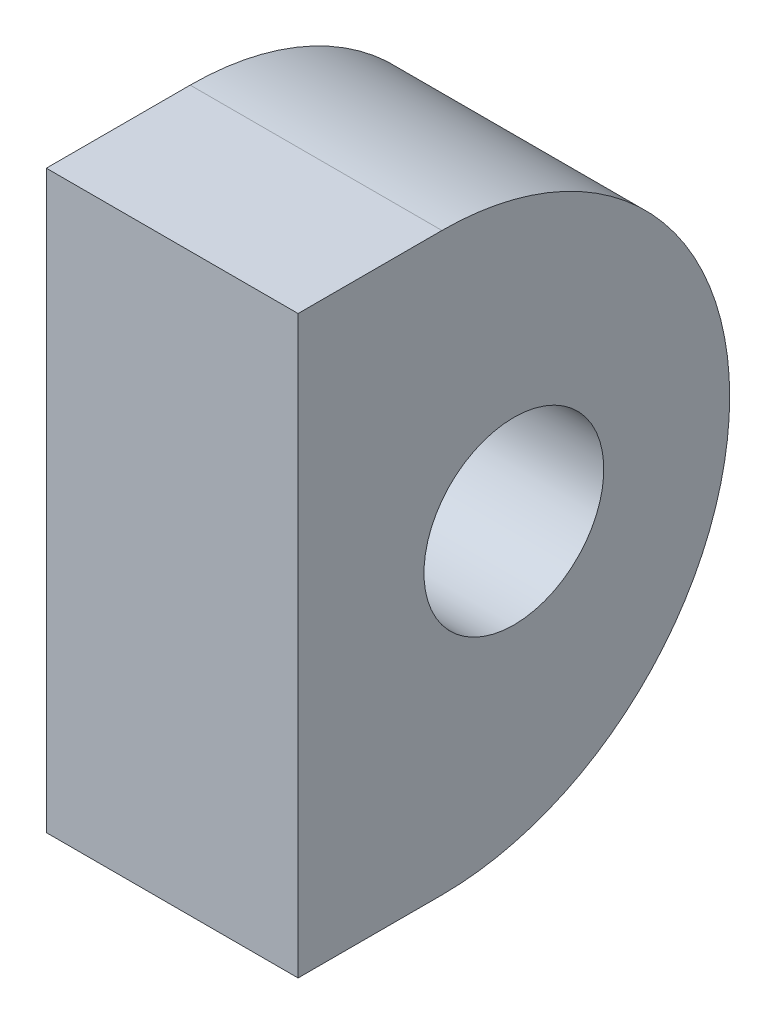
ISO-10303-21;
HEADER;
FILE_DESCRIPTION(('STEP AP214'),'2;1');
FILE_NAME('part.step','',(''),(''),'','','');
FILE_SCHEMA(('AUTOMOTIVE_DESIGN { 1 0 10303 214 1 1 1 1 }'));
ENDSEC;
DATA;
#1=APPLICATION_CONTEXT('core data for automotive mechanical design processes');
#2=APPLICATION_PROTOCOL_DEFINITION('international standard','automotive_design',2000,#1);
#3=PRODUCT_CONTEXT('',#1,'mechanical');
#4=PRODUCT('Part','Part','',(#3));
#5=PRODUCT_RELATED_PRODUCT_CATEGORY('part','',(#4));
#6=PRODUCT_DEFINITION_FORMATION('','',#4);
#7=PRODUCT_DEFINITION_CONTEXT('part definition',#1,'design');
#8=PRODUCT_DEFINITION('design','',#6,#7);
#9=PRODUCT_DEFINITION_SHAPE('','',#8);
#10=(LENGTH_UNIT() NAMED_UNIT(*) SI_UNIT(.MILLI.,.METRE.));
#11=(NAMED_UNIT(*) PLANE_ANGLE_UNIT() SI_UNIT($,.RADIAN.));
#12=(NAMED_UNIT(*) SI_UNIT($,.STERADIAN.) SOLID_ANGLE_UNIT());
#13=UNCERTAINTY_MEASURE_WITH_UNIT(LENGTH_MEASURE(1.E-05),#10,'distance_accuracy_value','');
#14=(GEOMETRIC_REPRESENTATION_CONTEXT(3) GLOBAL_UNCERTAINTY_ASSIGNED_CONTEXT((#13)) GLOBAL_UNIT_ASSIGNED_CONTEXT((#10,
#11,#12)) REPRESENTATION_CONTEXT('',''));
#15=CARTESIAN_POINT('',(0.,0.,0.));
#16=DIRECTION('',(0.,0.,1.));
#17=DIRECTION('',(1.,0.,0.));
#18=AXIS2_PLACEMENT_3D('',#15,#16,#17);
#19=CARTESIAN_POINT('',(0.,0.,-38.1));
#20=DIRECTION('',(1.,0.,0.));
#21=DIRECTION('',(0.,1.,0.));
#22=AXIS2_PLACEMENT_3D('',#19,#20,#21);
#23=PLANE('',#22);
#24=CARTESIAN_POINT('',(0.,25.4,-19.05));
#25=DIRECTION('',(-1.,0.,0.));
#26=DIRECTION('',(0.,1.,0.));
#27=AXIS2_PLACEMENT_3D('',#24,#25,#26);
#28=CIRCLE('',#27,7.9375);
#29=CARTESIAN_POINT('',(0.,33.3375,-19.05));
#30=VERTEX_POINT('',#29);
#31=EDGE_CURVE('E131',#30,#30,#28,.T.);
#32=ORIENTED_EDGE('',*,*,#31,.F.);
#33=EDGE_LOOP('',(#32));
#34=FACE_BOUND('',#33,.T.);
#35=DIRECTION('',(0.,0.,1.));
#36=VECTOR('',#35,1.);
#37=CARTESIAN_POINT('',(0.,0.,-38.1));
#38=LINE('',#37,#36);
#39=CARTESIAN_POINT('',(0.,0.,-12.7));
#40=VERTEX_POINT('',#39);
#41=CARTESIAN_POINT('',(0.,0.,0.));
#42=VERTEX_POINT('',#41);
#43=EDGE_CURVE('E89',#40,#42,#38,.T.);
#44=ORIENTED_EDGE('',*,*,#43,.T.);
#45=DIRECTION('',(0.,-1.,0.));
#46=VECTOR('',#45,1.);
#47=CARTESIAN_POINT('',(0.,0.,0.));
#48=LINE('',#47,#46);
#49=CARTESIAN_POINT('',(0.,50.8,0.));
#50=VERTEX_POINT('',#49);
#51=EDGE_CURVE('E95',#50,#42,#48,.T.);
#52=ORIENTED_EDGE('',*,*,#51,.F.);
#53=DIRECTION('',(0.,0.,1.));
#54=VECTOR('',#53,1.);
#55=CARTESIAN_POINT('',(0.,50.8,-38.1));
#56=LINE('',#55,#54);
#57=CARTESIAN_POINT('',(0.,50.8,-12.7));
#58=VERTEX_POINT('',#57);
#59=EDGE_CURVE('E121',#58,#50,#56,.T.);
#60=ORIENTED_EDGE('',*,*,#59,.F.);
#61=CARTESIAN_POINT('',(0.,25.4,-12.7));
#62=DIRECTION('',(-1.,0.,0.));
#63=DIRECTION('',(0.,1.,0.));
#64=AXIS2_PLACEMENT_3D('',#61,#62,#63);
#65=CIRCLE('',#64,25.4);
#66=CARTESIAN_POINT('',(0.,25.4,-38.1));
#67=VERTEX_POINT('',#66);
#68=EDGE_CURVE('E116',#67,#58,#65,.F.);
#69=ORIENTED_EDGE('',*,*,#68,.F.);
#70=CARTESIAN_POINT('',(0.,25.4,-12.7));
#71=DIRECTION('',(-1.,0.,0.));
#72=DIRECTION('',(0.,1.,0.));
#73=AXIS2_PLACEMENT_3D('',#70,#71,#72);
#74=CIRCLE('',#73,25.4);
#75=EDGE_CURVE('E46',#40,#67,#74,.F.);
#76=ORIENTED_EDGE('',*,*,#75,.F.);
#77=EDGE_LOOP('',(#44,#52,#60,#69,#76));
#78=FACE_BOUND('',#77,.T.);
#79=ADVANCED_FACE('F37',(#34,#78),#23,.F.);
#80=CARTESIAN_POINT('',(0.,0.,-38.1));
#81=DIRECTION('',(0.,1.,0.));
#82=DIRECTION('',(0.,0.,-1.));
#83=AXIS2_PLACEMENT_3D('',#80,#81,#82);
#84=PLANE('',#83);
#85=DIRECTION('',(0.,0.,1.));
#86=VECTOR('',#85,1.);
#87=CARTESIAN_POINT('',(22.225,0.,-38.1));
#88=LINE('',#87,#86);
#89=CARTESIAN_POINT('',(22.225,0.,-12.7));
#90=VERTEX_POINT('',#89);
#91=CARTESIAN_POINT('',(22.225,0.,0.));
#92=VERTEX_POINT('',#91);
#93=EDGE_CURVE('E91',#90,#92,#88,.T.);
#94=ORIENTED_EDGE('',*,*,#93,.T.);
#95=DIRECTION('',(1.,0.,0.));
#96=VECTOR('',#95,1.);
#97=CARTESIAN_POINT('',(0.,0.,0.));
#98=LINE('',#97,#96);
#99=EDGE_CURVE('E84',#42,#92,#98,.T.);
#100=ORIENTED_EDGE('',*,*,#99,.F.);
#101=ORIENTED_EDGE('',*,*,#43,.F.);
#102=DIRECTION('',(1.,0.,0.));
#103=VECTOR('',#102,1.);
#104=CARTESIAN_POINT('',(0.,0.,-12.7));
#105=LINE('',#104,#103);
#106=EDGE_CURVE('E114',#90,#40,#105,.F.);
#107=ORIENTED_EDGE('',*,*,#106,.F.);
#108=EDGE_LOOP('',(#94,#100,#101,#107));
#109=FACE_BOUND('',#108,.T.);
#110=ADVANCED_FACE('F86',(#109),#84,.F.);
#111=CARTESIAN_POINT('',(22.225,0.,-38.1));
#112=DIRECTION('',(-1.,0.,0.));
#113=DIRECTION('',(0.,-1.,0.));
#114=AXIS2_PLACEMENT_3D('',#111,#112,#113);
#115=PLANE('',#114);
#116=CARTESIAN_POINT('',(22.225,25.4,-19.05));
#117=DIRECTION('',(-1.,0.,0.));
#118=DIRECTION('',(0.,1.,0.));
#119=AXIS2_PLACEMENT_3D('',#116,#117,#118);
#120=CIRCLE('',#119,7.9375);
#121=CARTESIAN_POINT('',(22.225,33.3375,-19.05));
#122=VERTEX_POINT('',#121);
#123=EDGE_CURVE('E134',#122,#122,#120,.T.);
#124=ORIENTED_EDGE('',*,*,#123,.T.);
#125=EDGE_LOOP('',(#124));
#126=FACE_BOUND('',#125,.T.);
#127=CARTESIAN_POINT('',(22.225,25.4,-12.7));
#128=DIRECTION('',(1.,0.,0.));
#129=DIRECTION('',(0.,-1.,0.));
#130=AXIS2_PLACEMENT_3D('',#127,#128,#129);
#131=CIRCLE('',#130,25.4);
#132=CARTESIAN_POINT('',(22.225,50.8,-12.7));
#133=VERTEX_POINT('',#132);
#134=CARTESIAN_POINT('',(22.225,25.4,-38.1));
#135=VERTEX_POINT('',#134);
#136=EDGE_CURVE('E105',#133,#135,#131,.F.);
#137=ORIENTED_EDGE('',*,*,#136,.F.);
#138=DIRECTION('',(0.,0.,1.));
#139=VECTOR('',#138,1.);
#140=CARTESIAN_POINT('',(22.225,50.8,-38.1));
#141=LINE('',#140,#139);
#142=CARTESIAN_POINT('',(22.225,50.8,0.));
#143=VERTEX_POINT('',#142);
#144=EDGE_CURVE('E109',#133,#143,#141,.T.);
#145=ORIENTED_EDGE('',*,*,#144,.T.);
#146=DIRECTION('',(0.,1.,0.));
#147=VECTOR('',#146,1.);
#148=CARTESIAN_POINT('',(22.225,0.,0.));
#149=LINE('',#148,#147);
#150=EDGE_CURVE('E94',#92,#143,#149,.T.);
#151=ORIENTED_EDGE('',*,*,#150,.F.);
#152=ORIENTED_EDGE('',*,*,#93,.F.);
#153=CARTESIAN_POINT('',(22.225,25.4,-12.7));
#154=DIRECTION('',(1.,0.,0.));
#155=DIRECTION('',(0.,-1.,0.));
#156=AXIS2_PLACEMENT_3D('',#153,#154,#155);
#157=CIRCLE('',#156,25.4);
#158=EDGE_CURVE('E107',#135,#90,#157,.F.);
#159=ORIENTED_EDGE('',*,*,#158,.F.);
#160=EDGE_LOOP('',(#137,#145,#151,#152,#159));
#161=FACE_BOUND('',#160,.T.);
#162=ADVANCED_FACE('F126',(#126,#161),#115,.F.);
#163=CARTESIAN_POINT('',(0.,50.8,-38.1));
#164=DIRECTION('',(0.,-1.,0.));
#165=DIRECTION('',(0.,0.,1.));
#166=AXIS2_PLACEMENT_3D('',#163,#164,#165);
#167=PLANE('',#166);
#168=ORIENTED_EDGE('',*,*,#59,.T.);
#169=DIRECTION('',(-1.,0.,0.));
#170=VECTOR('',#169,1.);
#171=CARTESIAN_POINT('',(0.,50.8,0.));
#172=LINE('',#171,#170);
#173=EDGE_CURVE('E99',#143,#50,#172,.T.);
#174=ORIENTED_EDGE('',*,*,#173,.F.);
#175=ORIENTED_EDGE('',*,*,#144,.F.);
#176=DIRECTION('',(-1.,0.,0.));
#177=VECTOR('',#176,1.);
#178=CARTESIAN_POINT('',(0.,50.8,-12.7));
#179=LINE('',#178,#177);
#180=EDGE_CURVE('E11',#58,#133,#179,.F.);
#181=ORIENTED_EDGE('',*,*,#180,.F.);
#182=EDGE_LOOP('',(#168,#174,#175,#181));
#183=FACE_BOUND('',#182,.T.);
#184=ADVANCED_FACE('F124',(#183),#167,.F.);
#185=CARTESIAN_POINT('',(0.,0.,0.));
#186=DIRECTION('',(0.,0.,1.));
#187=DIRECTION('',(-1.,0.,0.));
#188=AXIS2_PLACEMENT_3D('',#185,#186,#187);
#189=PLANE('',#188);
#190=ORIENTED_EDGE('',*,*,#51,.T.);
#191=ORIENTED_EDGE('',*,*,#99,.T.);
#192=ORIENTED_EDGE('',*,*,#150,.T.);
#193=ORIENTED_EDGE('',*,*,#173,.T.);
#194=EDGE_LOOP('',(#190,#191,#192,#193));
#195=FACE_BOUND('',#194,.T.);
#196=ADVANCED_FACE('F98',(#195),#189,.T.);
#197=CARTESIAN_POINT('',(0.,25.4,-12.7));
#198=DIRECTION('',(-1.,0.,0.));
#199=DIRECTION('',(0.,0.,-1.));
#200=AXIS2_PLACEMENT_3D('',#197,#198,#199);
#201=CYLINDRICAL_SURFACE('',#200,25.4);
#202=ORIENTED_EDGE('',*,*,#180,.T.);
#203=ORIENTED_EDGE('',*,*,#136,.T.);
#204=DIRECTION('',(-1.,0.,0.));
#205=VECTOR('',#204,1.);
#206=CARTESIAN_POINT('',(0.,25.4,-38.1));
#207=LINE('',#206,#205);
#208=EDGE_CURVE('E41',#135,#67,#207,.T.);
#209=ORIENTED_EDGE('',*,*,#208,.T.);
#210=ORIENTED_EDGE('',*,*,#68,.T.);
#211=EDGE_LOOP('',(#202,#203,#209,#210));
#212=FACE_BOUND('',#211,.T.);
#213=ADVANCED_FACE('F39',(#212),#201,.T.);
#214=CARTESIAN_POINT('',(0.,25.4,-12.7));
#215=DIRECTION('',(1.,0.,0.));
#216=DIRECTION('',(0.,0.,1.));
#217=AXIS2_PLACEMENT_3D('',#214,#215,#216);
#218=CYLINDRICAL_SURFACE('',#217,25.4);
#219=ORIENTED_EDGE('',*,*,#75,.T.);
#220=ORIENTED_EDGE('',*,*,#208,.F.);
#221=ORIENTED_EDGE('',*,*,#158,.T.);
#222=ORIENTED_EDGE('',*,*,#106,.T.);
#223=EDGE_LOOP('',(#219,#220,#221,#222));
#224=FACE_BOUND('',#223,.T.);
#225=ADVANCED_FACE('F119',(#224),#218,.T.);
#226=CARTESIAN_POINT('',(-15.875,25.4,-19.05));
#227=DIRECTION('',(1.,0.,0.));
#228=DIRECTION('',(0.,1.,0.));
#229=AXIS2_PLACEMENT_3D('',#226,#227,#228);
#230=CYLINDRICAL_SURFACE('',#229,7.9375);
#231=CARTESIAN_POINT('',(22.225,33.3375,-19.05));
#232=CARTESIAN_POINT('',(21.9934895833333,33.3375,-19.05));
#233=CARTESIAN_POINT('',(21.7619791666667,33.3375,-19.05));
#234=CARTESIAN_POINT('',(21.2989583333333,33.3375,-19.05));
#235=CARTESIAN_POINT('',(21.0674479166667,33.3375,-19.05));
#236=CARTESIAN_POINT('',(20.6044270833333,33.3375,-19.05));
#237=CARTESIAN_POINT('',(20.3729166666667,33.3375,-19.05));
#238=CARTESIAN_POINT('',(19.9098958333333,33.3375,-19.05));
#239=CARTESIAN_POINT('',(19.6783854166667,33.3375,-19.05));
#240=CARTESIAN_POINT('',(19.2153645833333,33.3375,-19.05));
#241=CARTESIAN_POINT('',(18.9838541666667,33.3375,-19.05));
#242=CARTESIAN_POINT('',(18.5208333333333,33.3375,-19.05));
#243=CARTESIAN_POINT('',(18.2893229166667,33.3375,-19.05));
#244=CARTESIAN_POINT('',(17.8263020833333,33.3375,-19.05));
#245=CARTESIAN_POINT('',(17.5947916666667,33.3375,-19.05));
#246=CARTESIAN_POINT('',(17.1317708333333,33.3375,-19.05));
#247=CARTESIAN_POINT('',(16.9002604166667,33.3375,-19.05));
#248=CARTESIAN_POINT('',(16.4372395833333,33.3375,-19.05));
#249=CARTESIAN_POINT('',(16.2057291666667,33.3375,-19.05));
#250=CARTESIAN_POINT('',(15.7427083333333,33.3375,-19.05));
#251=CARTESIAN_POINT('',(15.5111979166667,33.3375,-19.05));
#252=CARTESIAN_POINT('',(15.0481770833333,33.3375,-19.05));
#253=CARTESIAN_POINT('',(14.8166666666667,33.3375,-19.05));
#254=CARTESIAN_POINT('',(14.3536458333333,33.3375,-19.05));
#255=CARTESIAN_POINT('',(14.1221354166667,33.3375,-19.05));
#256=CARTESIAN_POINT('',(13.6591145833333,33.3375,-19.05));
#257=CARTESIAN_POINT('',(13.4276041666667,33.3375,-19.05));
#258=CARTESIAN_POINT('',(12.9645833333333,33.3375,-19.05));
#259=CARTESIAN_POINT('',(12.7330729166667,33.3375,-19.05));
#260=CARTESIAN_POINT('',(12.2700520833333,33.3375,-19.05));
#261=CARTESIAN_POINT('',(12.0385416666667,33.3375,-19.05));
#262=CARTESIAN_POINT('',(11.5755208333333,33.3375,-19.05));
#263=CARTESIAN_POINT('',(11.3440104166667,33.3375,-19.05));
#264=CARTESIAN_POINT('',(10.8809895833333,33.3375,-19.05));
#265=CARTESIAN_POINT('',(10.6494791666667,33.3375,-19.05));
#266=CARTESIAN_POINT('',(10.1864583333333,33.3375,-19.05));
#267=CARTESIAN_POINT('',(9.95494791666666,33.3375,-19.05));
#268=CARTESIAN_POINT('',(9.49192708333333,33.3375,-19.05));
#269=CARTESIAN_POINT('',(9.26041666666666,33.3375,-19.05));
#270=CARTESIAN_POINT('',(8.79739583333333,33.3375,-19.05));
#271=CARTESIAN_POINT('',(8.56588541666666,33.3375,-19.05));
#272=CARTESIAN_POINT('',(8.10286458333333,33.3375,-19.05));
#273=CARTESIAN_POINT('',(7.87135416666666,33.3375,-19.05));
#274=CARTESIAN_POINT('',(7.40833333333333,33.3375,-19.05));
#275=CARTESIAN_POINT('',(7.17682291666666,33.3375,-19.05));
#276=CARTESIAN_POINT('',(6.71380208333333,33.3375,-19.05));
#277=CARTESIAN_POINT('',(6.48229166666666,33.3375,-19.05));
#278=CARTESIAN_POINT('',(6.01927083333333,33.3375,-19.05));
#279=CARTESIAN_POINT('',(5.78776041666666,33.3375,-19.05));
#280=CARTESIAN_POINT('',(5.32473958333333,33.3375,-19.05));
#281=CARTESIAN_POINT('',(5.09322916666666,33.3375,-19.05));
#282=CARTESIAN_POINT('',(4.63020833333333,33.3375,-19.05));
#283=CARTESIAN_POINT('',(4.39869791666666,33.3375,-19.05));
#284=CARTESIAN_POINT('',(3.93567708333333,33.3375,-19.05));
#285=CARTESIAN_POINT('',(3.70416666666666,33.3375,-19.05));
#286=CARTESIAN_POINT('',(3.24114583333333,33.3375,-19.05));
#287=CARTESIAN_POINT('',(3.00963541666666,33.3375,-19.05));
#288=CARTESIAN_POINT('',(2.54661458333333,33.3375,-19.05));
#289=CARTESIAN_POINT('',(2.31510416666666,33.3375,-19.05));
#290=CARTESIAN_POINT('',(1.85208333333333,33.3375,-19.05));
#291=CARTESIAN_POINT('',(1.62057291666666,33.3375,-19.05));
#292=CARTESIAN_POINT('',(1.15755208333333,33.3375,-19.05));
#293=CARTESIAN_POINT('',(0.926041666666661,33.3375,-19.05));
#294=CARTESIAN_POINT('',(0.463020833333327,33.3375,-19.05));
#295=CARTESIAN_POINT('',(0.23151041666666,33.3375,-19.05));
#296=CARTESIAN_POINT('',(0.,33.3375,-19.05));
#297=B_SPLINE_CURVE_WITH_KNOTS('',3,(#231,#232,#233,#234,#235,#236,#237,#238,#239,#240,#241,
#242,#243,#244,#245,#246,#247,#248,#249,#250,#251,#252,#253,#254,#255,#256,#257,#258,#259,#260,
#261,#262,#263,#264,#265,#266,#267,#268,#269,#270,#271,#272,#273,#274,#275,#276,#277,#278,#279,
#280,#281,#282,#283,#284,#285,#286,#287,#288,#289,#290,#291,#292,#293,#294,#295,#296),
.UNSPECIFIED.,.F.,.F.,(4,2,2,2,2,2,2,2,2,2,2,2,2,2,2,2,2,2,2,2,2,2,2,2,2,2,2,2,2,2,2,2,4),(0.,
0.694531249999998,1.3890625,2.08359375,2.778125,3.47265625,4.1671875,4.86171875,5.55625,
6.25078125,6.9453125,7.63984375,8.334375,9.02890625,9.7234375,10.41796875,11.1125,11.80703125,
12.5015625,13.19609375,13.890625,14.58515625,15.2796875,15.97421875,16.66875,17.36328125,
18.0578125,18.75234375,19.446875,20.14140625,20.8359375,21.53046875,22.225),.UNSPECIFIED.);
#298=EDGE_CURVE('BSEAM139',#122,#30,#297,.T.);
#299=ORIENTED_EDGE('',*,*,#123,.F.);
#300=ORIENTED_EDGE('',*,*,#31,.T.);
#301=ORIENTED_EDGE('',*,*,#298,.T.);
#302=ORIENTED_EDGE('',*,*,#298,.F.);
#303=EDGE_LOOP('',(#299,#301,#300,#302));
#304=FACE_BOUND('',#303,.T.);
#305=ADVANCED_FACE('F139',(#304),#230,.F.);
#306=CLOSED_SHELL('',(#79,#110,#162,#184,#196,#213,#225,#305));
#307=MANIFOLD_SOLID_BREP('B2',#306);
#308=ADVANCED_BREP_SHAPE_REPRESENTATION('',(#18,#307),#14);
#309=SHAPE_DEFINITION_REPRESENTATION(#9,#308);
ENDSEC;
END-ISO-10303-21;
